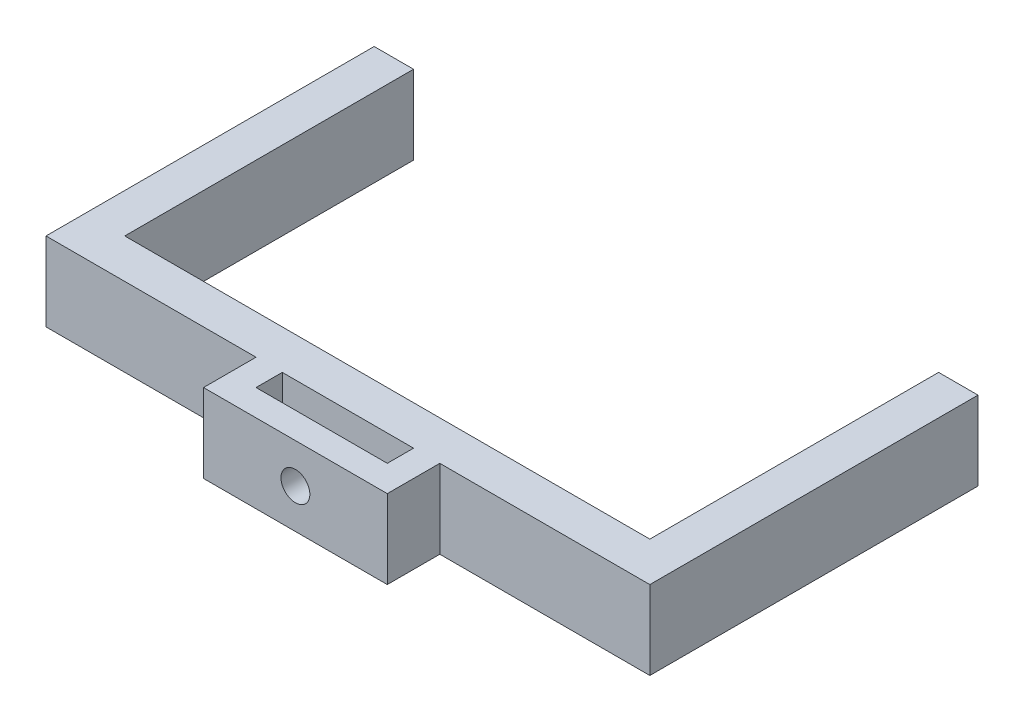
ISO-10303-21;
HEADER;
FILE_DESCRIPTION(('STEP AP214'),'2;1');
FILE_NAME('part.step','',(''),(''),'','','');
FILE_SCHEMA(('AUTOMOTIVE_DESIGN { 1 0 10303 214 1 1 1 1 }'));
ENDSEC;
DATA;
#1=APPLICATION_CONTEXT('core data for automotive mechanical design processes');
#2=APPLICATION_PROTOCOL_DEFINITION('international standard','automotive_design',2000,#1);
#3=PRODUCT_CONTEXT('',#1,'mechanical');
#4=PRODUCT('Part','Part','',(#3));
#5=PRODUCT_RELATED_PRODUCT_CATEGORY('part','',(#4));
#6=PRODUCT_DEFINITION_FORMATION('','',#4);
#7=PRODUCT_DEFINITION_CONTEXT('part definition',#1,'design');
#8=PRODUCT_DEFINITION('design','',#6,#7);
#9=PRODUCT_DEFINITION_SHAPE('','',#8);
#10=(LENGTH_UNIT() NAMED_UNIT(*) SI_UNIT(.MILLI.,.METRE.));
#11=(NAMED_UNIT(*) PLANE_ANGLE_UNIT() SI_UNIT($,.RADIAN.));
#12=(NAMED_UNIT(*) SI_UNIT($,.STERADIAN.) SOLID_ANGLE_UNIT());
#13=UNCERTAINTY_MEASURE_WITH_UNIT(LENGTH_MEASURE(1.E-05),#10,'distance_accuracy_value','');
#14=(GEOMETRIC_REPRESENTATION_CONTEXT(3) GLOBAL_UNCERTAINTY_ASSIGNED_CONTEXT((#13)) GLOBAL_UNIT_ASSIGNED_CONTEXT((#10,
#11,#12)) REPRESENTATION_CONTEXT('',''));
#15=CARTESIAN_POINT('',(0.,0.,0.));
#16=DIRECTION('',(0.,0.,1.));
#17=DIRECTION('',(1.,0.,0.));
#18=AXIS2_PLACEMENT_3D('',#15,#16,#17);
#19=CARTESIAN_POINT('',(-3.,6.,0.));
#20=DIRECTION('',(-1.,0.,0.));
#21=DIRECTION('',(0.,0.,1.));
#22=AXIS2_PLACEMENT_3D('',#19,#20,#21);
#23=PLANE('',#22);
#24=DIRECTION('',(0.,0.,-1.));
#25=VECTOR('',#24,1.);
#26=CARTESIAN_POINT('',(-3.,0.,0.));
#27=LINE('',#26,#25);
#28=CARTESIAN_POINT('',(-3.,0.,0.));
#29=VERTEX_POINT('',#28);
#30=CARTESIAN_POINT('',(-3.,0.,-25.));
#31=VERTEX_POINT('',#30);
#32=EDGE_CURVE('E218',#29,#31,#27,.T.);
#33=ORIENTED_EDGE('',*,*,#32,.F.);
#34=DIRECTION('',(0.,-1.,0.));
#35=VECTOR('',#34,1.);
#36=CARTESIAN_POINT('',(-3.,6.,0.));
#37=LINE('',#36,#35);
#38=CARTESIAN_POINT('',(-3.,6.,0.));
#39=VERTEX_POINT('',#38);
#40=EDGE_CURVE('E11',#39,#29,#37,.T.);
#41=ORIENTED_EDGE('',*,*,#40,.F.);
#42=DIRECTION('',(0.,0.,-1.));
#43=VECTOR('',#42,1.);
#44=CARTESIAN_POINT('',(-3.,6.,0.));
#45=LINE('',#44,#43);
#46=CARTESIAN_POINT('',(-3.,6.,-25.));
#47=VERTEX_POINT('',#46);
#48=EDGE_CURVE('E318',#39,#47,#45,.T.);
#49=ORIENTED_EDGE('',*,*,#48,.T.);
#50=DIRECTION('',(0.,-1.,0.));
#51=VECTOR('',#50,1.);
#52=CARTESIAN_POINT('',(-3.,6.,-25.));
#53=LINE('',#52,#51);
#54=EDGE_CURVE('E122',#47,#31,#53,.T.);
#55=ORIENTED_EDGE('',*,*,#54,.T.);
#56=EDGE_LOOP('',(#33,#41,#49,#55));
#57=FACE_BOUND('',#56,.T.);
#58=ADVANCED_FACE('F43',(#57),#23,.T.);
#59=CARTESIAN_POINT('',(0.,6.,0.));
#60=DIRECTION('',(0.,0.,1.));
#61=DIRECTION('',(1.,0.,0.));
#62=AXIS2_PLACEMENT_3D('',#59,#60,#61);
#63=PLANE('',#62);
#64=DIRECTION('',(-1.,0.,0.));
#65=VECTOR('',#64,1.);
#66=CARTESIAN_POINT('',(0.,0.,0.));
#67=LINE('',#66,#65);
#68=CARTESIAN_POINT('',(13.,0.,0.));
#69=VERTEX_POINT('',#68);
#70=EDGE_CURVE('E221',#69,#29,#67,.T.);
#71=ORIENTED_EDGE('',*,*,#70,.F.);
#72=DIRECTION('',(0.,-1.,0.));
#73=VECTOR('',#72,1.);
#74=CARTESIAN_POINT('',(13.,6.,0.));
#75=LINE('',#74,#73);
#76=CARTESIAN_POINT('',(13.,6.,0.));
#77=VERTEX_POINT('',#76);
#78=EDGE_CURVE('E54',#77,#69,#75,.T.);
#79=ORIENTED_EDGE('',*,*,#78,.F.);
#80=DIRECTION('',(-1.,0.,0.));
#81=VECTOR('',#80,1.);
#82=CARTESIAN_POINT('',(0.,6.,0.));
#83=LINE('',#82,#81);
#84=EDGE_CURVE('E323',#77,#39,#83,.T.);
#85=ORIENTED_EDGE('',*,*,#84,.T.);
#86=ORIENTED_EDGE('',*,*,#40,.T.);
#87=EDGE_LOOP('',(#71,#79,#85,#86));
#88=FACE_BOUND('',#87,.T.);
#89=ADVANCED_FACE('F371',(#88),#63,.T.);
#90=CARTESIAN_POINT('',(13.,6.,0.));
#91=DIRECTION('',(-1.,0.,0.));
#92=DIRECTION('',(0.,0.,1.));
#93=AXIS2_PLACEMENT_3D('',#90,#91,#92);
#94=PLANE('',#93);
#95=DIRECTION('',(0.,0.,-1.));
#96=VECTOR('',#95,1.);
#97=CARTESIAN_POINT('',(13.,0.,0.));
#98=LINE('',#97,#96);
#99=CARTESIAN_POINT('',(13.,0.,4.));
#100=VERTEX_POINT('',#99);
#101=EDGE_CURVE('E225',#100,#69,#98,.T.);
#102=ORIENTED_EDGE('',*,*,#101,.F.);
#103=DIRECTION('',(0.,-1.,0.));
#104=VECTOR('',#103,1.);
#105=CARTESIAN_POINT('',(13.,6.,4.));
#106=LINE('',#105,#104);
#107=CARTESIAN_POINT('',(13.,6.,4.));
#108=VERTEX_POINT('',#107);
#109=EDGE_CURVE('E284',#108,#100,#106,.T.);
#110=ORIENTED_EDGE('',*,*,#109,.F.);
#111=DIRECTION('',(0.,0.,-1.));
#112=VECTOR('',#111,1.);
#113=CARTESIAN_POINT('',(13.,6.,0.));
#114=LINE('',#113,#112);
#115=EDGE_CURVE('E331',#108,#77,#114,.T.);
#116=ORIENTED_EDGE('',*,*,#115,.T.);
#117=ORIENTED_EDGE('',*,*,#78,.T.);
#118=EDGE_LOOP('',(#102,#110,#116,#117));
#119=FACE_BOUND('',#118,.T.);
#120=ADVANCED_FACE('F376',(#119),#94,.T.);
#121=CARTESIAN_POINT('',(0.,6.,4.));
#122=DIRECTION('',(0.,0.,1.));
#123=DIRECTION('',(1.,0.,0.));
#124=AXIS2_PLACEMENT_3D('',#121,#122,#123);
#125=PLANE('',#124);
#126=CARTESIAN_POINT('',(20.,3.,4.));
#127=DIRECTION('',(0.,0.,1.));
#128=DIRECTION('',(1.,0.,0.));
#129=AXIS2_PLACEMENT_3D('',#126,#127,#128);
#130=CIRCLE('',#129,1.1);
#131=CARTESIAN_POINT('',(21.1,3.,4.));
#132=VERTEX_POINT('',#131);
#133=EDGE_CURVE('E392',#132,#132,#130,.T.);
#134=ORIENTED_EDGE('',*,*,#133,.F.);
#135=EDGE_LOOP('',(#134));
#136=FACE_BOUND('',#135,.T.);
#137=DIRECTION('',(-1.,0.,0.));
#138=VECTOR('',#137,1.);
#139=CARTESIAN_POINT('',(0.,0.,4.));
#140=LINE('',#139,#138);
#141=CARTESIAN_POINT('',(27.,0.,4.));
#142=VERTEX_POINT('',#141);
#143=EDGE_CURVE('E229',#142,#100,#140,.T.);
#144=ORIENTED_EDGE('',*,*,#143,.F.);
#145=DIRECTION('',(0.,-1.,0.));
#146=VECTOR('',#145,1.);
#147=CARTESIAN_POINT('',(27.,6.,4.));
#148=LINE('',#147,#146);
#149=CARTESIAN_POINT('',(27.,6.,4.));
#150=VERTEX_POINT('',#149);
#151=EDGE_CURVE('E281',#150,#142,#148,.T.);
#152=ORIENTED_EDGE('',*,*,#151,.F.);
#153=DIRECTION('',(-1.,0.,0.));
#154=VECTOR('',#153,1.);
#155=CARTESIAN_POINT('',(0.,6.,4.));
#156=LINE('',#155,#154);
#157=EDGE_CURVE('E335',#150,#108,#156,.T.);
#158=ORIENTED_EDGE('',*,*,#157,.T.);
#159=ORIENTED_EDGE('',*,*,#109,.T.);
#160=EDGE_LOOP('',(#144,#152,#158,#159));
#161=FACE_BOUND('',#160,.T.);
#162=ADVANCED_FACE('F403',(#136,#161),#125,.T.);
#163=CARTESIAN_POINT('',(27.,6.,0.));
#164=DIRECTION('',(-1.,0.,0.));
#165=DIRECTION('',(0.,0.,1.));
#166=AXIS2_PLACEMENT_3D('',#163,#164,#165);
#167=PLANE('',#166);
#168=DIRECTION('',(0.,0.,-1.));
#169=VECTOR('',#168,1.);
#170=CARTESIAN_POINT('',(27.,0.,0.));
#171=LINE('',#170,#169);
#172=CARTESIAN_POINT('',(27.,0.,0.));
#173=VERTEX_POINT('',#172);
#174=EDGE_CURVE('E233',#142,#173,#171,.T.);
#175=ORIENTED_EDGE('',*,*,#174,.T.);
#176=DIRECTION('',(0.,-1.,0.));
#177=VECTOR('',#176,1.);
#178=CARTESIAN_POINT('',(27.,6.,0.));
#179=LINE('',#178,#177);
#180=CARTESIAN_POINT('',(27.,6.,0.));
#181=VERTEX_POINT('',#180);
#182=EDGE_CURVE('E277',#181,#173,#179,.T.);
#183=ORIENTED_EDGE('',*,*,#182,.F.);
#184=DIRECTION('',(0.,0.,-1.));
#185=VECTOR('',#184,1.);
#186=CARTESIAN_POINT('',(27.,6.,0.));
#187=LINE('',#186,#185);
#188=EDGE_CURVE('E339',#150,#181,#187,.T.);
#189=ORIENTED_EDGE('',*,*,#188,.F.);
#190=ORIENTED_EDGE('',*,*,#151,.T.);
#191=EDGE_LOOP('',(#175,#183,#189,#190));
#192=FACE_BOUND('',#191,.T.);
#193=ADVANCED_FACE('F406',(#192),#167,.F.);
#194=CARTESIAN_POINT('',(0.,6.,0.));
#195=DIRECTION('',(0.,0.,-1.));
#196=DIRECTION('',(-1.,0.,0.));
#197=AXIS2_PLACEMENT_3D('',#194,#195,#196);
#198=PLANE('',#197);
#199=DIRECTION('',(1.,0.,0.));
#200=VECTOR('',#199,1.);
#201=CARTESIAN_POINT('',(0.,0.,0.));
#202=LINE('',#201,#200);
#203=CARTESIAN_POINT('',(43.,0.,0.));
#204=VERTEX_POINT('',#203);
#205=EDGE_CURVE('E237',#173,#204,#202,.T.);
#206=ORIENTED_EDGE('',*,*,#205,.T.);
#207=DIRECTION('',(0.,-1.,0.));
#208=VECTOR('',#207,1.);
#209=CARTESIAN_POINT('',(43.,6.,0.));
#210=LINE('',#209,#208);
#211=CARTESIAN_POINT('',(43.,6.,0.));
#212=VERTEX_POINT('',#211);
#213=EDGE_CURVE('E273',#212,#204,#210,.T.);
#214=ORIENTED_EDGE('',*,*,#213,.F.);
#215=DIRECTION('',(1.,0.,0.));
#216=VECTOR('',#215,1.);
#217=CARTESIAN_POINT('',(0.,6.,0.));
#218=LINE('',#217,#216);
#219=EDGE_CURVE('E343',#181,#212,#218,.T.);
#220=ORIENTED_EDGE('',*,*,#219,.F.);
#221=ORIENTED_EDGE('',*,*,#182,.T.);
#222=EDGE_LOOP('',(#206,#214,#220,#221));
#223=FACE_BOUND('',#222,.T.);
#224=ADVANCED_FACE('F425',(#223),#198,.F.);
#225=CARTESIAN_POINT('',(43.,6.,0.));
#226=DIRECTION('',(-1.,0.,0.));
#227=DIRECTION('',(0.,0.,1.));
#228=AXIS2_PLACEMENT_3D('',#225,#226,#227);
#229=PLANE('',#228);
#230=DIRECTION('',(0.,0.,-1.));
#231=VECTOR('',#230,1.);
#232=CARTESIAN_POINT('',(43.,0.,0.));
#233=LINE('',#232,#231);
#234=CARTESIAN_POINT('',(43.,0.,-25.));
#235=VERTEX_POINT('',#234);
#236=EDGE_CURVE('E241',#204,#235,#233,.T.);
#237=ORIENTED_EDGE('',*,*,#236,.T.);
#238=DIRECTION('',(0.,-1.,0.));
#239=VECTOR('',#238,1.);
#240=CARTESIAN_POINT('',(43.,6.,-25.));
#241=LINE('',#240,#239);
#242=CARTESIAN_POINT('',(43.,6.,-25.));
#243=VERTEX_POINT('',#242);
#244=EDGE_CURVE('E270',#243,#235,#241,.T.);
#245=ORIENTED_EDGE('',*,*,#244,.F.);
#246=DIRECTION('',(0.,0.,-1.));
#247=VECTOR('',#246,1.);
#248=CARTESIAN_POINT('',(43.,6.,0.));
#249=LINE('',#248,#247);
#250=EDGE_CURVE('E347',#212,#243,#249,.T.);
#251=ORIENTED_EDGE('',*,*,#250,.F.);
#252=ORIENTED_EDGE('',*,*,#213,.T.);
#253=EDGE_LOOP('',(#237,#245,#251,#252));
#254=FACE_BOUND('',#253,.T.);
#255=ADVANCED_FACE('F428',(#254),#229,.F.);
#256=CARTESIAN_POINT('',(0.,6.,-25.));
#257=DIRECTION('',(0.,0.,-1.));
#258=DIRECTION('',(-1.,0.,0.));
#259=AXIS2_PLACEMENT_3D('',#256,#257,#258);
#260=PLANE('',#259);
#261=DIRECTION('',(1.,0.,0.));
#262=VECTOR('',#261,1.);
#263=CARTESIAN_POINT('',(0.,0.,-25.));
#264=LINE('',#263,#262);
#265=CARTESIAN_POINT('',(40.,0.,-25.));
#266=VERTEX_POINT('',#265);
#267=EDGE_CURVE('E245',#266,#235,#264,.T.);
#268=ORIENTED_EDGE('',*,*,#267,.F.);
#269=DIRECTION('',(0.,-1.,0.));
#270=VECTOR('',#269,1.);
#271=CARTESIAN_POINT('',(40.,6.,-25.));
#272=LINE('',#271,#270);
#273=CARTESIAN_POINT('',(40.,6.,-25.));
#274=VERTEX_POINT('',#273);
#275=EDGE_CURVE('E267',#274,#266,#272,.T.);
#276=ORIENTED_EDGE('',*,*,#275,.F.);
#277=DIRECTION('',(1.,0.,0.));
#278=VECTOR('',#277,1.);
#279=CARTESIAN_POINT('',(0.,6.,-25.));
#280=LINE('',#279,#278);
#281=EDGE_CURVE('E195',#274,#243,#280,.T.);
#282=ORIENTED_EDGE('',*,*,#281,.T.);
#283=ORIENTED_EDGE('',*,*,#244,.T.);
#284=EDGE_LOOP('',(#268,#276,#282,#283));
#285=FACE_BOUND('',#284,.T.);
#286=ADVANCED_FACE('F353',(#285),#260,.T.);
#287=CARTESIAN_POINT('',(40.,6.,0.));
#288=DIRECTION('',(-1.,0.,0.));
#289=DIRECTION('',(0.,0.,1.));
#290=AXIS2_PLACEMENT_3D('',#287,#288,#289);
#291=PLANE('',#290);
#292=DIRECTION('',(0.,0.,-1.));
#293=VECTOR('',#292,1.);
#294=CARTESIAN_POINT('',(40.,0.,0.));
#295=LINE('',#294,#293);
#296=CARTESIAN_POINT('',(40.,0.,-3.));
#297=VERTEX_POINT('',#296);
#298=EDGE_CURVE('E249',#297,#266,#295,.T.);
#299=ORIENTED_EDGE('',*,*,#298,.F.);
#300=DIRECTION('',(0.,-1.,0.));
#301=VECTOR('',#300,1.);
#302=CARTESIAN_POINT('',(40.,6.,-3.));
#303=LINE('',#302,#301);
#304=CARTESIAN_POINT('',(40.,6.,-3.));
#305=VERTEX_POINT('',#304);
#306=EDGE_CURVE('E179',#305,#297,#303,.T.);
#307=ORIENTED_EDGE('',*,*,#306,.F.);
#308=DIRECTION('',(0.,0.,-1.));
#309=VECTOR('',#308,1.);
#310=CARTESIAN_POINT('',(40.,6.,0.));
#311=LINE('',#310,#309);
#312=EDGE_CURVE('E191',#305,#274,#311,.T.);
#313=ORIENTED_EDGE('',*,*,#312,.T.);
#314=ORIENTED_EDGE('',*,*,#275,.T.);
#315=EDGE_LOOP('',(#299,#307,#313,#314));
#316=FACE_BOUND('',#315,.T.);
#317=ADVANCED_FACE('F357',(#316),#291,.T.);
#318=CARTESIAN_POINT('',(0.,6.,-3.));
#319=DIRECTION('',(0.,0.,-1.));
#320=DIRECTION('',(-1.,0.,0.));
#321=AXIS2_PLACEMENT_3D('',#318,#319,#320);
#322=PLANE('',#321);
#323=DIRECTION('',(1.,0.,0.));
#324=VECTOR('',#323,1.);
#325=CARTESIAN_POINT('',(0.,0.,-3.));
#326=LINE('',#325,#324);
#327=CARTESIAN_POINT('',(0.,0.,-3.));
#328=VERTEX_POINT('',#327);
#329=EDGE_CURVE('E175',#328,#297,#326,.T.);
#330=ORIENTED_EDGE('',*,*,#329,.F.);
#331=DIRECTION('',(0.,-1.,0.));
#332=VECTOR('',#331,1.);
#333=CARTESIAN_POINT('',(0.,6.,-3.));
#334=LINE('',#333,#332);
#335=CARTESIAN_POINT('',(0.,6.,-3.));
#336=VERTEX_POINT('',#335);
#337=EDGE_CURVE('E169',#336,#328,#334,.T.);
#338=ORIENTED_EDGE('',*,*,#337,.F.);
#339=DIRECTION('',(1.,0.,0.));
#340=VECTOR('',#339,1.);
#341=CARTESIAN_POINT('',(0.,6.,-3.));
#342=LINE('',#341,#340);
#343=EDGE_CURVE('E173',#336,#305,#342,.T.);
#344=ORIENTED_EDGE('',*,*,#343,.T.);
#345=ORIENTED_EDGE('',*,*,#306,.T.);
#346=EDGE_LOOP('',(#330,#338,#344,#345));
#347=FACE_BOUND('',#346,.T.);
#348=ADVANCED_FACE('F171',(#347),#322,.T.);
#349=CARTESIAN_POINT('',(0.,6.,0.));
#350=DIRECTION('',(-1.,0.,0.));
#351=DIRECTION('',(0.,0.,1.));
#352=AXIS2_PLACEMENT_3D('',#349,#350,#351);
#353=PLANE('',#352);
#354=DIRECTION('',(0.,0.,-1.));
#355=VECTOR('',#354,1.);
#356=CARTESIAN_POINT('',(0.,0.,0.));
#357=LINE('',#356,#355);
#358=CARTESIAN_POINT('',(0.,0.,-25.));
#359=VERTEX_POINT('',#358);
#360=EDGE_CURVE('E255',#328,#359,#357,.T.);
#361=ORIENTED_EDGE('',*,*,#360,.T.);
#362=DIRECTION('',(0.,-1.,0.));
#363=VECTOR('',#362,1.);
#364=CARTESIAN_POINT('',(0.,6.,-25.));
#365=LINE('',#364,#363);
#366=CARTESIAN_POINT('',(0.,6.,-25.));
#367=VERTEX_POINT('',#366);
#368=EDGE_CURVE('E180',#367,#359,#365,.T.);
#369=ORIENTED_EDGE('',*,*,#368,.F.);
#370=DIRECTION('',(0.,0.,-1.));
#371=VECTOR('',#370,1.);
#372=CARTESIAN_POINT('',(0.,6.,0.));
#373=LINE('',#372,#371);
#374=EDGE_CURVE('E183',#336,#367,#373,.T.);
#375=ORIENTED_EDGE('',*,*,#374,.F.);
#376=ORIENTED_EDGE('',*,*,#337,.T.);
#377=EDGE_LOOP('',(#361,#369,#375,#376));
#378=FACE_BOUND('',#377,.T.);
#379=ADVANCED_FACE('F184',(#378),#353,.F.);
#380=CARTESIAN_POINT('',(25.,6.,0.));
#381=DIRECTION('',(-1.,0.,0.));
#382=DIRECTION('',(0.,0.,1.));
#383=AXIS2_PLACEMENT_3D('',#380,#381,#382);
#384=PLANE('',#383);
#385=DIRECTION('',(0.,0.,-1.));
#386=VECTOR('',#385,1.);
#387=CARTESIAN_POINT('',(25.,0.,0.));
#388=LINE('',#387,#386);
#389=CARTESIAN_POINT('',(25.,0.,2.));
#390=VERTEX_POINT('',#389);
#391=CARTESIAN_POINT('',(25.,0.,0.));
#392=VERTEX_POINT('',#391);
#393=EDGE_CURVE('E202',#390,#392,#388,.T.);
#394=ORIENTED_EDGE('',*,*,#393,.F.);
#395=DIRECTION('',(0.,-1.,0.));
#396=VECTOR('',#395,1.);
#397=CARTESIAN_POINT('',(25.,6.,2.));
#398=LINE('',#397,#396);
#399=CARTESIAN_POINT('',(25.,6.,2.));
#400=VERTEX_POINT('',#399);
#401=EDGE_CURVE('E47',#400,#390,#398,.T.);
#402=ORIENTED_EDGE('',*,*,#401,.F.);
#403=DIRECTION('',(0.,0.,-1.));
#404=VECTOR('',#403,1.);
#405=CARTESIAN_POINT('',(25.,6.,0.));
#406=LINE('',#405,#404);
#407=CARTESIAN_POINT('',(25.,6.,0.));
#408=VERTEX_POINT('',#407);
#409=EDGE_CURVE('E260',#400,#408,#406,.T.);
#410=ORIENTED_EDGE('',*,*,#409,.T.);
#411=DIRECTION('',(0.,-1.,0.));
#412=VECTOR('',#411,1.);
#413=CARTESIAN_POINT('',(25.,6.,0.));
#414=LINE('',#413,#412);
#415=EDGE_CURVE('E201',#408,#392,#414,.T.);
#416=ORIENTED_EDGE('',*,*,#415,.T.);
#417=EDGE_LOOP('',(#394,#402,#410,#416));
#418=FACE_BOUND('',#417,.T.);
#419=ADVANCED_FACE('F45',(#418),#384,.T.);
#420=CARTESIAN_POINT('',(0.,6.,2.));
#421=DIRECTION('',(0.,0.,-1.));
#422=DIRECTION('',(-1.,0.,0.));
#423=AXIS2_PLACEMENT_3D('',#420,#421,#422);
#424=PLANE('',#423);
#425=CARTESIAN_POINT('',(20.,3.,2.));
#426=DIRECTION('',(0.,0.,1.));
#427=DIRECTION('',(1.,0.,0.));
#428=AXIS2_PLACEMENT_3D('',#425,#426,#427);
#429=CIRCLE('',#428,1.1);
#430=CARTESIAN_POINT('',(21.1,3.,2.));
#431=VERTEX_POINT('',#430);
#432=EDGE_CURVE('E207',#431,#431,#429,.T.);
#433=ORIENTED_EDGE('',*,*,#432,.T.);
#434=EDGE_LOOP('',(#433));
#435=FACE_BOUND('',#434,.T.);
#436=DIRECTION('',(1.,0.,0.));
#437=VECTOR('',#436,1.);
#438=CARTESIAN_POINT('',(0.,0.,2.));
#439=LINE('',#438,#437);
#440=CARTESIAN_POINT('',(15.,0.,2.));
#441=VERTEX_POINT('',#440);
#442=EDGE_CURVE('E206',#441,#390,#439,.T.);
#443=ORIENTED_EDGE('',*,*,#442,.F.);
#444=DIRECTION('',(0.,-1.,0.));
#445=VECTOR('',#444,1.);
#446=CARTESIAN_POINT('',(15.,6.,2.));
#447=LINE('',#446,#445);
#448=CARTESIAN_POINT('',(15.,6.,2.));
#449=VERTEX_POINT('',#448);
#450=EDGE_CURVE('E294',#449,#441,#447,.T.);
#451=ORIENTED_EDGE('',*,*,#450,.F.);
#452=DIRECTION('',(1.,0.,0.));
#453=VECTOR('',#452,1.);
#454=CARTESIAN_POINT('',(0.,6.,2.));
#455=LINE('',#454,#453);
#456=EDGE_CURVE('E305',#449,#400,#455,.T.);
#457=ORIENTED_EDGE('',*,*,#456,.T.);
#458=ORIENTED_EDGE('',*,*,#401,.T.);
#459=EDGE_LOOP('',(#443,#451,#457,#458));
#460=FACE_BOUND('',#459,.T.);
#461=ADVANCED_FACE('F303',(#435,#460),#424,.T.);
#462=CARTESIAN_POINT('',(15.,6.,0.));
#463=DIRECTION('',(-1.,0.,0.));
#464=DIRECTION('',(0.,0.,1.));
#465=AXIS2_PLACEMENT_3D('',#462,#463,#464);
#466=PLANE('',#465);
#467=DIRECTION('',(0.,0.,-1.));
#468=VECTOR('',#467,1.);
#469=CARTESIAN_POINT('',(15.,0.,0.));
#470=LINE('',#469,#468);
#471=CARTESIAN_POINT('',(15.,0.,0.));
#472=VERTEX_POINT('',#471);
#473=EDGE_CURVE('E211',#441,#472,#470,.T.);
#474=ORIENTED_EDGE('',*,*,#473,.T.);
#475=DIRECTION('',(0.,-1.,0.));
#476=VECTOR('',#475,1.);
#477=CARTESIAN_POINT('',(15.,6.,0.));
#478=LINE('',#477,#476);
#479=CARTESIAN_POINT('',(15.,6.,0.));
#480=VERTEX_POINT('',#479);
#481=EDGE_CURVE('E291',#480,#472,#478,.T.);
#482=ORIENTED_EDGE('',*,*,#481,.F.);
#483=DIRECTION('',(0.,0.,-1.));
#484=VECTOR('',#483,1.);
#485=CARTESIAN_POINT('',(15.,6.,0.));
#486=LINE('',#485,#484);
#487=EDGE_CURVE('E319',#449,#480,#486,.T.);
#488=ORIENTED_EDGE('',*,*,#487,.F.);
#489=ORIENTED_EDGE('',*,*,#450,.T.);
#490=EDGE_LOOP('',(#474,#482,#488,#489));
#491=FACE_BOUND('',#490,.T.);
#492=ADVANCED_FACE('F311',(#491),#466,.F.);
#493=CARTESIAN_POINT('',(0.,6.,0.));
#494=DIRECTION('',(0.,0.,-1.));
#495=DIRECTION('',(-1.,0.,0.));
#496=AXIS2_PLACEMENT_3D('',#493,#494,#495);
#497=PLANE('',#496);
#498=DIRECTION('',(1.,0.,0.));
#499=VECTOR('',#498,1.);
#500=CARTESIAN_POINT('',(0.,0.,0.));
#501=LINE('',#500,#499);
#502=EDGE_CURVE('E214',#472,#392,#501,.T.);
#503=ORIENTED_EDGE('',*,*,#502,.T.);
#504=ORIENTED_EDGE('',*,*,#415,.F.);
#505=DIRECTION('',(1.,0.,0.));
#506=VECTOR('',#505,1.);
#507=CARTESIAN_POINT('',(0.,6.,0.));
#508=LINE('',#507,#506);
#509=EDGE_CURVE('E315',#480,#408,#508,.T.);
#510=ORIENTED_EDGE('',*,*,#509,.F.);
#511=ORIENTED_EDGE('',*,*,#481,.T.);
#512=EDGE_LOOP('',(#503,#504,#510,#511));
#513=FACE_BOUND('',#512,.T.);
#514=ADVANCED_FACE('F314',(#513),#497,.F.);
#515=CARTESIAN_POINT('',(0.,6.,-25.));
#516=DIRECTION('',(0.,0.,1.));
#517=DIRECTION('',(1.,0.,0.));
#518=AXIS2_PLACEMENT_3D('',#515,#516,#517);
#519=PLANE('',#518);
#520=DIRECTION('',(-1.,0.,0.));
#521=VECTOR('',#520,1.);
#522=CARTESIAN_POINT('',(0.,0.,-25.));
#523=LINE('',#522,#521);
#524=EDGE_CURVE('E115',#359,#31,#523,.T.);
#525=ORIENTED_EDGE('',*,*,#524,.T.);
#526=ORIENTED_EDGE('',*,*,#54,.F.);
#527=DIRECTION('',(-1.,0.,0.));
#528=VECTOR('',#527,1.);
#529=CARTESIAN_POINT('',(0.,6.,-25.));
#530=LINE('',#529,#528);
#531=EDGE_CURVE('E63',#367,#47,#530,.T.);
#532=ORIENTED_EDGE('',*,*,#531,.F.);
#533=ORIENTED_EDGE('',*,*,#368,.T.);
#534=EDGE_LOOP('',(#525,#526,#532,#533));
#535=FACE_BOUND('',#534,.T.);
#536=ADVANCED_FACE('F367',(#535),#519,.F.);
#537=CARTESIAN_POINT('',(0.,6.,0.));
#538=DIRECTION('',(0.,1.,0.));
#539=DIRECTION('',(0.,0.,1.));
#540=AXIS2_PLACEMENT_3D('',#537,#538,#539);
#541=PLANE('',#540);
#542=ORIENTED_EDGE('',*,*,#409,.F.);
#543=ORIENTED_EDGE('',*,*,#456,.F.);
#544=ORIENTED_EDGE('',*,*,#487,.T.);
#545=ORIENTED_EDGE('',*,*,#509,.T.);
#546=EDGE_LOOP('',(#542,#543,#544,#545));
#547=FACE_BOUND('',#546,.T.);
#548=ORIENTED_EDGE('',*,*,#48,.F.);
#549=ORIENTED_EDGE('',*,*,#84,.F.);
#550=ORIENTED_EDGE('',*,*,#115,.F.);
#551=ORIENTED_EDGE('',*,*,#157,.F.);
#552=ORIENTED_EDGE('',*,*,#188,.T.);
#553=ORIENTED_EDGE('',*,*,#219,.T.);
#554=ORIENTED_EDGE('',*,*,#250,.T.);
#555=ORIENTED_EDGE('',*,*,#281,.F.);
#556=ORIENTED_EDGE('',*,*,#312,.F.);
#557=ORIENTED_EDGE('',*,*,#343,.F.);
#558=ORIENTED_EDGE('',*,*,#374,.T.);
#559=ORIENTED_EDGE('',*,*,#531,.T.);
#560=EDGE_LOOP('',(#548,#549,#550,#551,#552,#553,#554,#555,#556,#557,#558,#559));
#561=FACE_BOUND('',#560,.T.);
#562=ADVANCED_FACE('F188',(#547,#561),#541,.T.);
#563=CARTESIAN_POINT('',(0.,0.,0.));
#564=DIRECTION('',(0.,1.,0.));
#565=DIRECTION('',(0.,0.,1.));
#566=AXIS2_PLACEMENT_3D('',#563,#564,#565);
#567=PLANE('',#566);
#568=ORIENTED_EDGE('',*,*,#393,.T.);
#569=ORIENTED_EDGE('',*,*,#502,.F.);
#570=ORIENTED_EDGE('',*,*,#473,.F.);
#571=ORIENTED_EDGE('',*,*,#442,.T.);
#572=EDGE_LOOP('',(#568,#569,#570,#571));
#573=FACE_BOUND('',#572,.T.);
#574=ORIENTED_EDGE('',*,*,#32,.T.);
#575=ORIENTED_EDGE('',*,*,#524,.F.);
#576=ORIENTED_EDGE('',*,*,#360,.F.);
#577=ORIENTED_EDGE('',*,*,#329,.T.);
#578=ORIENTED_EDGE('',*,*,#298,.T.);
#579=ORIENTED_EDGE('',*,*,#267,.T.);
#580=ORIENTED_EDGE('',*,*,#236,.F.);
#581=ORIENTED_EDGE('',*,*,#205,.F.);
#582=ORIENTED_EDGE('',*,*,#174,.F.);
#583=ORIENTED_EDGE('',*,*,#143,.T.);
#584=ORIENTED_EDGE('',*,*,#101,.T.);
#585=ORIENTED_EDGE('',*,*,#70,.T.);
#586=EDGE_LOOP('',(#574,#575,#576,#577,#578,#579,#580,#581,#582,#583,#584,#585));
#587=FACE_BOUND('',#586,.T.);
#588=ADVANCED_FACE('F309',(#573,#587),#567,.F.);
#589=CARTESIAN_POINT('',(20.,3.,2.));
#590=DIRECTION('',(0.,0.,1.));
#591=DIRECTION('',(1.,0.,0.));
#592=AXIS2_PLACEMENT_3D('',#589,#590,#591);
#593=CYLINDRICAL_SURFACE('',#592,1.1);
#594=ORIENTED_EDGE('',*,*,#432,.F.);
#595=EDGE_LOOP('',(#594));
#596=FACE_BOUND('',#595,.T.);
#597=ORIENTED_EDGE('',*,*,#133,.T.);
#598=EDGE_LOOP('',(#597));
#599=FACE_BOUND('',#598,.T.);
#600=ADVANCED_FACE('F359',(#596,#599),#593,.F.);
#601=CLOSED_SHELL('',(#58,#89,#120,#162,#193,#224,#255,#286,#317,#348,#379,#419,#461,#492,#514,
#536,#562,#588,#600));
#602=MANIFOLD_SOLID_BREP('B2',#601);
#603=ADVANCED_BREP_SHAPE_REPRESENTATION('',(#18,#602),#14);
#604=SHAPE_DEFINITION_REPRESENTATION(#9,#603);
ENDSEC;
END-ISO-10303-21;
